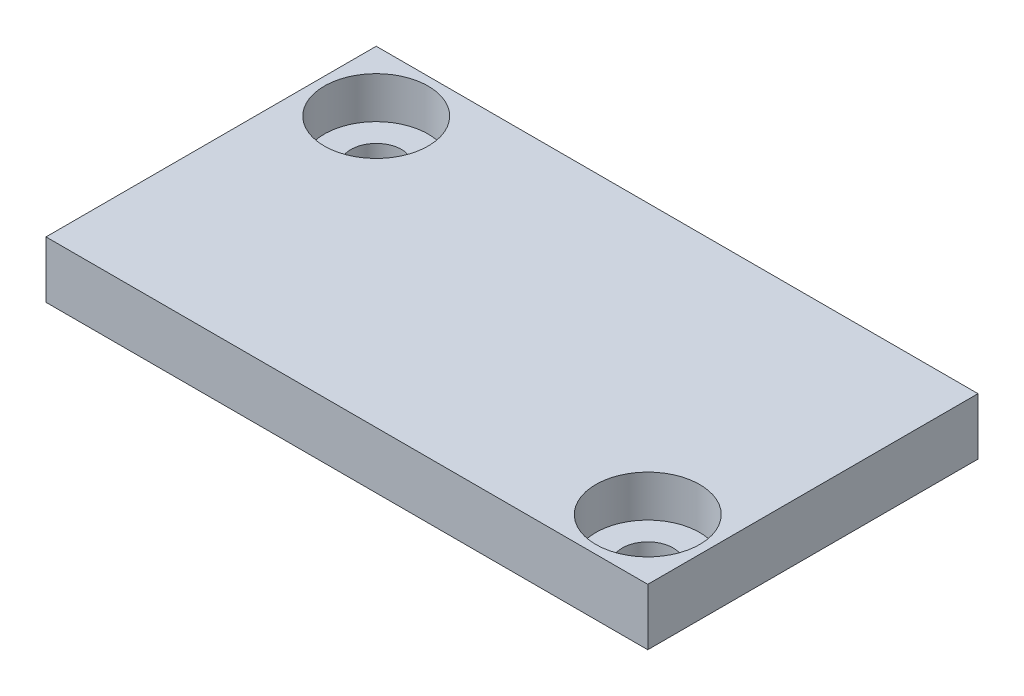
ISO-10303-21;
HEADER;
FILE_DESCRIPTION(('STEP AP214'),'2;1');
FILE_NAME('part.step','',(''),(''),'','','');
FILE_SCHEMA(('AUTOMOTIVE_DESIGN { 1 0 10303 214 1 1 1 1 }'));
ENDSEC;
DATA;
#1=APPLICATION_CONTEXT('core data for automotive mechanical design processes');
#2=APPLICATION_PROTOCOL_DEFINITION('international standard','automotive_design',2000,#1);
#3=PRODUCT_CONTEXT('',#1,'mechanical');
#4=PRODUCT('Part','Part','',(#3));
#5=PRODUCT_RELATED_PRODUCT_CATEGORY('part','',(#4));
#6=PRODUCT_DEFINITION_FORMATION('','',#4);
#7=PRODUCT_DEFINITION_CONTEXT('part definition',#1,'design');
#8=PRODUCT_DEFINITION('design','',#6,#7);
#9=PRODUCT_DEFINITION_SHAPE('','',#8);
#10=(LENGTH_UNIT() NAMED_UNIT(*) SI_UNIT(.MILLI.,.METRE.));
#11=(NAMED_UNIT(*) PLANE_ANGLE_UNIT() SI_UNIT($,.RADIAN.));
#12=(NAMED_UNIT(*) SI_UNIT($,.STERADIAN.) SOLID_ANGLE_UNIT());
#13=UNCERTAINTY_MEASURE_WITH_UNIT(LENGTH_MEASURE(1.E-05),#10,'distance_accuracy_value','');
#14=(GEOMETRIC_REPRESENTATION_CONTEXT(3) GLOBAL_UNCERTAINTY_ASSIGNED_CONTEXT((#13)) GLOBAL_UNIT_ASSIGNED_CONTEXT((#10,
#11,#12)) REPRESENTATION_CONTEXT('',''));
#15=CARTESIAN_POINT('',(0.,0.,0.));
#16=DIRECTION('',(0.,0.,1.));
#17=DIRECTION('',(1.,0.,0.));
#18=AXIS2_PLACEMENT_3D('',#15,#16,#17);
#19=CARTESIAN_POINT('',(20.2204689047881,3.81,-11.096598789213));
#20=DIRECTION('',(-1.,0.,0.));
#21=DIRECTION('',(0.,0.,1.));
#22=AXIS2_PLACEMENT_3D('',#19,#20,#21);
#23=PLANE('',#22);
#24=DIRECTION('',(0.,0.,-1.));
#25=VECTOR('',#24,1.);
#26=CARTESIAN_POINT('',(20.2204689047881,0.,-11.096598789213));
#27=LINE('',#26,#25);
#28=CARTESIAN_POINT('',(20.2204689047881,0.,11.096598789213));
#29=VERTEX_POINT('',#28);
#30=CARTESIAN_POINT('',(20.2204689047881,0.,-11.096598789213));
#31=VERTEX_POINT('',#30);
#32=EDGE_CURVE('E103',#29,#31,#27,.T.);
#33=ORIENTED_EDGE('',*,*,#32,.T.);
#34=DIRECTION('',(0.,-1.,0.));
#35=VECTOR('',#34,1.);
#36=CARTESIAN_POINT('',(20.2204689047881,3.81,-11.096598789213));
#37=LINE('',#36,#35);
#38=CARTESIAN_POINT('',(20.2204689047881,3.81,-11.096598789213));
#39=VERTEX_POINT('',#38);
#40=EDGE_CURVE('E11',#39,#31,#37,.T.);
#41=ORIENTED_EDGE('',*,*,#40,.F.);
#42=DIRECTION('',(0.,0.,-1.));
#43=VECTOR('',#42,1.);
#44=CARTESIAN_POINT('',(20.2204689047881,3.81,-11.096598789213));
#45=LINE('',#44,#43);
#46=CARTESIAN_POINT('',(20.2204689047881,3.81,11.096598789213));
#47=VERTEX_POINT('',#46);
#48=EDGE_CURVE('E90',#47,#39,#45,.T.);
#49=ORIENTED_EDGE('',*,*,#48,.F.);
#50=DIRECTION('',(0.,-1.,0.));
#51=VECTOR('',#50,1.);
#52=CARTESIAN_POINT('',(20.2204689047881,3.81,11.096598789213));
#53=LINE('',#52,#51);
#54=EDGE_CURVE('E99',#47,#29,#53,.T.);
#55=ORIENTED_EDGE('',*,*,#54,.T.);
#56=EDGE_LOOP('',(#33,#41,#49,#55));
#57=FACE_BOUND('',#56,.T.);
#58=ADVANCED_FACE('F37',(#57),#23,.F.);
#59=CARTESIAN_POINT('',(-20.2204689047881,3.81,-11.096598789213));
#60=DIRECTION('',(0.,0.,1.));
#61=DIRECTION('',(1.,0.,0.));
#62=AXIS2_PLACEMENT_3D('',#59,#60,#61);
#63=PLANE('',#62);
#64=DIRECTION('',(-1.,0.,0.));
#65=VECTOR('',#64,1.);
#66=CARTESIAN_POINT('',(-20.2204689047881,0.,-11.096598789213));
#67=LINE('',#66,#65);
#68=CARTESIAN_POINT('',(-20.2204689047881,0.,-11.096598789213));
#69=VERTEX_POINT('',#68);
#70=EDGE_CURVE('E94',#31,#69,#67,.T.);
#71=ORIENTED_EDGE('',*,*,#70,.T.);
#72=DIRECTION('',(0.,-1.,0.));
#73=VECTOR('',#72,1.);
#74=CARTESIAN_POINT('',(-20.2204689047881,3.81,-11.096598789213));
#75=LINE('',#74,#73);
#76=CARTESIAN_POINT('',(-20.2204689047881,3.81,-11.096598789213));
#77=VERTEX_POINT('',#76);
#78=EDGE_CURVE('E46',#77,#69,#75,.T.);
#79=ORIENTED_EDGE('',*,*,#78,.F.);
#80=DIRECTION('',(-1.,0.,0.));
#81=VECTOR('',#80,1.);
#82=CARTESIAN_POINT('',(-20.2204689047881,3.81,-11.096598789213));
#83=LINE('',#82,#81);
#84=EDGE_CURVE('E85',#39,#77,#83,.T.);
#85=ORIENTED_EDGE('',*,*,#84,.F.);
#86=ORIENTED_EDGE('',*,*,#40,.T.);
#87=EDGE_LOOP('',(#71,#79,#85,#86));
#88=FACE_BOUND('',#87,.T.);
#89=ADVANCED_FACE('F93',(#88),#63,.F.);
#90=CARTESIAN_POINT('',(-20.2204689047881,3.81,-11.096598789213));
#91=DIRECTION('',(1.,0.,0.));
#92=DIRECTION('',(0.,0.,-1.));
#93=AXIS2_PLACEMENT_3D('',#90,#91,#92);
#94=PLANE('',#93);
#95=DIRECTION('',(0.,0.,1.));
#96=VECTOR('',#95,1.);
#97=CARTESIAN_POINT('',(-20.2204689047881,0.,-11.096598789213));
#98=LINE('',#97,#96);
#99=CARTESIAN_POINT('',(-20.2204689047881,0.,11.096598789213));
#100=VERTEX_POINT('',#99);
#101=EDGE_CURVE('E72',#69,#100,#98,.T.);
#102=ORIENTED_EDGE('',*,*,#101,.T.);
#103=DIRECTION('',(0.,-1.,0.));
#104=VECTOR('',#103,1.);
#105=CARTESIAN_POINT('',(-20.2204689047881,3.81,11.096598789213));
#106=LINE('',#105,#104);
#107=CARTESIAN_POINT('',(-20.2204689047881,3.81,11.096598789213));
#108=VERTEX_POINT('',#107);
#109=EDGE_CURVE('E95',#108,#100,#106,.T.);
#110=ORIENTED_EDGE('',*,*,#109,.F.);
#111=DIRECTION('',(0.,0.,1.));
#112=VECTOR('',#111,1.);
#113=CARTESIAN_POINT('',(-20.2204689047881,3.81,-11.096598789213));
#114=LINE('',#113,#112);
#115=EDGE_CURVE('E88',#77,#108,#114,.T.);
#116=ORIENTED_EDGE('',*,*,#115,.F.);
#117=ORIENTED_EDGE('',*,*,#78,.T.);
#118=EDGE_LOOP('',(#102,#110,#116,#117));
#119=FACE_BOUND('',#118,.T.);
#120=ADVANCED_FACE('F97',(#119),#94,.F.);
#121=CARTESIAN_POINT('',(-20.2204689047881,3.81,11.096598789213));
#122=DIRECTION('',(0.,0.,-1.));
#123=DIRECTION('',(-1.,0.,0.));
#124=AXIS2_PLACEMENT_3D('',#121,#122,#123);
#125=PLANE('',#124);
#126=DIRECTION('',(1.,0.,0.));
#127=VECTOR('',#126,1.);
#128=CARTESIAN_POINT('',(-20.2204689047881,0.,11.096598789213));
#129=LINE('',#128,#127);
#130=EDGE_CURVE('E78',#100,#29,#129,.T.);
#131=ORIENTED_EDGE('',*,*,#130,.T.);
#132=ORIENTED_EDGE('',*,*,#54,.F.);
#133=DIRECTION('',(1.,0.,0.));
#134=VECTOR('',#133,1.);
#135=CARTESIAN_POINT('',(-20.2204689047881,3.81,11.096598789213));
#136=LINE('',#135,#134);
#137=EDGE_CURVE('E55',#108,#47,#136,.T.);
#138=ORIENTED_EDGE('',*,*,#137,.F.);
#139=ORIENTED_EDGE('',*,*,#109,.T.);
#140=EDGE_LOOP('',(#131,#132,#138,#139));
#141=FACE_BOUND('',#140,.T.);
#142=ADVANCED_FACE('F147',(#141),#125,.F.);
#143=CARTESIAN_POINT('',(0.,3.81,0.));
#144=DIRECTION('',(0.,1.,0.));
#145=DIRECTION('',(0.,0.,1.));
#146=AXIS2_PLACEMENT_3D('',#143,#144,#145);
#147=PLANE('',#146);
#148=CARTESIAN_POINT('',(-16.1564689047881,3.81,-7.03259878921299));
#149=DIRECTION('',(0.,1.,0.));
#150=DIRECTION('',(0.,0.,1.));
#151=AXIS2_PLACEMENT_3D('',#148,#149,#150);
#152=CIRCLE('',#151,3.4925);
#153=CARTESIAN_POINT('',(-16.1564689047881,3.81,-3.54009878921299));
#154=VERTEX_POINT('',#153);
#155=EDGE_CURVE('E128',#154,#154,#152,.T.);
#156=ORIENTED_EDGE('',*,*,#155,.F.);
#157=EDGE_LOOP('',(#156));
#158=FACE_BOUND('',#157,.T.);
#159=CARTESIAN_POINT('',(16.1564689047881,3.81,7.03259878921299));
#160=DIRECTION('',(0.,1.,0.));
#161=DIRECTION('',(0.,0.,1.));
#162=AXIS2_PLACEMENT_3D('',#159,#160,#161);
#163=CIRCLE('',#162,3.4925);
#164=CARTESIAN_POINT('',(16.1564689047881,3.81,10.525098789213));
#165=VERTEX_POINT('',#164);
#166=EDGE_CURVE('E131',#165,#165,#163,.T.);
#167=ORIENTED_EDGE('',*,*,#166,.F.);
#168=EDGE_LOOP('',(#167));
#169=FACE_BOUND('',#168,.T.);
#170=ORIENTED_EDGE('',*,*,#48,.T.);
#171=ORIENTED_EDGE('',*,*,#84,.T.);
#172=ORIENTED_EDGE('',*,*,#115,.T.);
#173=ORIENTED_EDGE('',*,*,#137,.T.);
#174=EDGE_LOOP('',(#170,#171,#172,#173));
#175=FACE_BOUND('',#174,.T.);
#176=ADVANCED_FACE('F86',(#158,#169,#175),#147,.T.);
#177=CARTESIAN_POINT('',(0.,0.,0.));
#178=DIRECTION('',(0.,1.,0.));
#179=DIRECTION('',(0.,0.,1.));
#180=AXIS2_PLACEMENT_3D('',#177,#178,#179);
#181=PLANE('',#180);
#182=CARTESIAN_POINT('',(-16.1564689047881,0.,-7.03259878921299));
#183=DIRECTION('',(0.,1.,0.));
#184=DIRECTION('',(0.,0.,1.));
#185=AXIS2_PLACEMENT_3D('',#182,#183,#184);
#186=CIRCLE('',#185,1.7018);
#187=CARTESIAN_POINT('',(-16.1564689047881,0.,-5.33079878921299));
#188=VERTEX_POINT('',#187);
#189=EDGE_CURVE('E113',#188,#188,#186,.T.);
#190=ORIENTED_EDGE('',*,*,#189,.T.);
#191=EDGE_LOOP('',(#190));
#192=FACE_BOUND('',#191,.T.);
#193=CARTESIAN_POINT('',(16.1564689047881,0.,7.03259878921299));
#194=DIRECTION('',(0.,1.,0.));
#195=DIRECTION('',(0.,0.,1.));
#196=AXIS2_PLACEMENT_3D('',#193,#194,#195);
#197=CIRCLE('',#196,1.7018);
#198=CARTESIAN_POINT('',(16.1564689047881,0.,8.734398789213));
#199=VERTEX_POINT('',#198);
#200=EDGE_CURVE('E119',#199,#199,#197,.T.);
#201=ORIENTED_EDGE('',*,*,#200,.T.);
#202=EDGE_LOOP('',(#201));
#203=FACE_BOUND('',#202,.T.);
#204=ORIENTED_EDGE('',*,*,#32,.F.);
#205=ORIENTED_EDGE('',*,*,#130,.F.);
#206=ORIENTED_EDGE('',*,*,#101,.F.);
#207=ORIENTED_EDGE('',*,*,#70,.F.);
#208=EDGE_LOOP('',(#204,#205,#206,#207));
#209=FACE_BOUND('',#208,.T.);
#210=ADVANCED_FACE('F142',(#192,#203,#209),#181,.F.);
#211=CARTESIAN_POINT('',(16.1564689047881,1.016,7.03259878921299));
#212=DIRECTION('',(0.,1.,0.));
#213=DIRECTION('',(0.,0.,1.));
#214=AXIS2_PLACEMENT_3D('',#211,#212,#213);
#215=CYLINDRICAL_SURFACE('',#214,3.4925);
#216=CARTESIAN_POINT('',(16.1564689047881,1.016,7.03259878921299));
#217=DIRECTION('',(0.,1.,0.));
#218=DIRECTION('',(0.,0.,1.));
#219=AXIS2_PLACEMENT_3D('',#216,#217,#218);
#220=CIRCLE('',#219,3.4925);
#221=CARTESIAN_POINT('',(16.1564689047881,1.016,10.525098789213));
#222=VERTEX_POINT('',#221);
#223=EDGE_CURVE('E117',#222,#222,#220,.T.);
#224=ORIENTED_EDGE('',*,*,#223,.F.);
#225=EDGE_LOOP('',(#224));
#226=FACE_BOUND('',#225,.T.);
#227=ORIENTED_EDGE('',*,*,#166,.T.);
#228=EDGE_LOOP('',(#227));
#229=FACE_BOUND('',#228,.T.);
#230=ADVANCED_FACE('F139',(#226,#229),#215,.F.);
#231=CARTESIAN_POINT('',(16.1564689047881,1.016,7.03259878921299));
#232=DIRECTION('',(0.,1.,0.));
#233=DIRECTION('',(0.,0.,1.));
#234=AXIS2_PLACEMENT_3D('',#231,#232,#233);
#235=PLANE('',#234);
#236=CARTESIAN_POINT('',(16.1564689047881,1.016,7.03259878921299));
#237=DIRECTION('',(0.,1.,0.));
#238=DIRECTION('',(0.,0.,1.));
#239=AXIS2_PLACEMENT_3D('',#236,#237,#238);
#240=CIRCLE('',#239,1.7018);
#241=CARTESIAN_POINT('',(16.1564689047881,1.016,8.734398789213));
#242=VERTEX_POINT('',#241);
#243=EDGE_CURVE('E40',#242,#242,#240,.T.);
#244=ORIENTED_EDGE('',*,*,#243,.F.);
#245=EDGE_LOOP('',(#244));
#246=FACE_BOUND('',#245,.T.);
#247=ORIENTED_EDGE('',*,*,#223,.T.);
#248=EDGE_LOOP('',(#247));
#249=FACE_BOUND('',#248,.T.);
#250=ADVANCED_FACE('F137',(#246,#249),#235,.T.);
#251=CARTESIAN_POINT('',(-16.1564689047881,1.016,-7.03259878921299));
#252=DIRECTION('',(0.,1.,0.));
#253=DIRECTION('',(0.,0.,1.));
#254=AXIS2_PLACEMENT_3D('',#251,#252,#253);
#255=CYLINDRICAL_SURFACE('',#254,3.4925);
#256=CARTESIAN_POINT('',(-16.1564689047881,1.016,-7.03259878921299));
#257=DIRECTION('',(0.,1.,0.));
#258=DIRECTION('',(0.,0.,1.));
#259=AXIS2_PLACEMENT_3D('',#256,#257,#258);
#260=CIRCLE('',#259,3.4925);
#261=CARTESIAN_POINT('',(-16.1564689047881,1.016,-3.54009878921299));
#262=VERTEX_POINT('',#261);
#263=EDGE_CURVE('E106',#262,#262,#260,.T.);
#264=ORIENTED_EDGE('',*,*,#263,.F.);
#265=EDGE_LOOP('',(#264));
#266=FACE_BOUND('',#265,.T.);
#267=ORIENTED_EDGE('',*,*,#155,.T.);
#268=EDGE_LOOP('',(#267));
#269=FACE_BOUND('',#268,.T.);
#270=ADVANCED_FACE('F193',(#266,#269),#255,.F.);
#271=CARTESIAN_POINT('',(-16.1564689047881,1.016,-7.03259878921299));
#272=DIRECTION('',(0.,1.,0.));
#273=DIRECTION('',(0.,0.,1.));
#274=AXIS2_PLACEMENT_3D('',#271,#272,#273);
#275=PLANE('',#274);
#276=CARTESIAN_POINT('',(-16.1564689047881,1.016,-7.03259878921299));
#277=DIRECTION('',(0.,1.,0.));
#278=DIRECTION('',(0.,0.,1.));
#279=AXIS2_PLACEMENT_3D('',#276,#277,#278);
#280=CIRCLE('',#279,1.7018);
#281=CARTESIAN_POINT('',(-16.1564689047881,1.016,-5.33079878921299));
#282=VERTEX_POINT('',#281);
#283=EDGE_CURVE('E111',#282,#282,#280,.T.);
#284=ORIENTED_EDGE('',*,*,#283,.F.);
#285=EDGE_LOOP('',(#284));
#286=FACE_BOUND('',#285,.T.);
#287=ORIENTED_EDGE('',*,*,#263,.T.);
#288=EDGE_LOOP('',(#287));
#289=FACE_BOUND('',#288,.T.);
#290=ADVANCED_FACE('F198',(#286,#289),#275,.T.);
#291=CARTESIAN_POINT('',(-16.1564689047881,0.,-7.03259878921299));
#292=DIRECTION('',(0.,1.,0.));
#293=DIRECTION('',(0.,0.,1.));
#294=AXIS2_PLACEMENT_3D('',#291,#292,#293);
#295=CYLINDRICAL_SURFACE('',#294,1.7018);
#296=CARTESIAN_POINT('',(-16.1564689047881,1.016,-5.33079878921299));
#297=CARTESIAN_POINT('',(-16.1564689047881,1.00541666666667,-5.33079878921299));
#298=CARTESIAN_POINT('',(-16.1564689047881,0.994833333333333,-5.33079878921299));
#299=CARTESIAN_POINT('',(-16.1564689047881,0.973666666666666,-5.33079878921299));
#300=CARTESIAN_POINT('',(-16.1564689047881,0.963083333333333,-5.33079878921299));
#301=CARTESIAN_POINT('',(-16.1564689047881,0.941916666666666,-5.33079878921299));
#302=CARTESIAN_POINT('',(-16.1564689047881,0.931333333333333,-5.33079878921299));
#303=CARTESIAN_POINT('',(-16.1564689047881,0.910166666666666,-5.33079878921299));
#304=CARTESIAN_POINT('',(-16.1564689047881,0.899583333333333,-5.33079878921299));
#305=CARTESIAN_POINT('',(-16.1564689047881,0.878416666666666,-5.33079878921299));
#306=CARTESIAN_POINT('',(-16.1564689047881,0.867833333333333,-5.33079878921299));
#307=CARTESIAN_POINT('',(-16.1564689047881,0.846666666666666,-5.33079878921299));
#308=CARTESIAN_POINT('',(-16.1564689047881,0.836083333333333,-5.33079878921299));
#309=CARTESIAN_POINT('',(-16.1564689047881,0.814916666666666,-5.33079878921299));
#310=CARTESIAN_POINT('',(-16.1564689047881,0.804333333333333,-5.33079878921299));
#311=CARTESIAN_POINT('',(-16.1564689047881,0.783166666666666,-5.33079878921299));
#312=CARTESIAN_POINT('',(-16.1564689047881,0.772583333333333,-5.33079878921299));
#313=CARTESIAN_POINT('',(-16.1564689047881,0.751416666666666,-5.33079878921299));
#314=CARTESIAN_POINT('',(-16.1564689047881,0.740833333333333,-5.33079878921299));
#315=CARTESIAN_POINT('',(-16.1564689047881,0.719666666666666,-5.33079878921299));
#316=CARTESIAN_POINT('',(-16.1564689047881,0.709083333333333,-5.33079878921299));
#317=CARTESIAN_POINT('',(-16.1564689047881,0.687916666666666,-5.33079878921299));
#318=CARTESIAN_POINT('',(-16.1564689047881,0.677333333333333,-5.33079878921299));
#319=CARTESIAN_POINT('',(-16.1564689047881,0.656166666666666,-5.33079878921299));
#320=CARTESIAN_POINT('',(-16.1564689047881,0.645583333333333,-5.33079878921299));
#321=CARTESIAN_POINT('',(-16.1564689047881,0.624416666666666,-5.33079878921299));
#322=CARTESIAN_POINT('',(-16.1564689047881,0.613833333333333,-5.33079878921299));
#323=CARTESIAN_POINT('',(-16.1564689047881,0.592666666666666,-5.33079878921299));
#324=CARTESIAN_POINT('',(-16.1564689047881,0.582083333333333,-5.33079878921299));
#325=CARTESIAN_POINT('',(-16.1564689047881,0.560916666666666,-5.33079878921299));
#326=CARTESIAN_POINT('',(-16.1564689047881,0.550333333333333,-5.33079878921299));
#327=CARTESIAN_POINT('',(-16.1564689047881,0.529166666666666,-5.33079878921299));
#328=CARTESIAN_POINT('',(-16.1564689047881,0.518583333333333,-5.33079878921299));
#329=CARTESIAN_POINT('',(-16.1564689047881,0.497416666666666,-5.33079878921299));
#330=CARTESIAN_POINT('',(-16.1564689047881,0.486833333333333,-5.33079878921299));
#331=CARTESIAN_POINT('',(-16.1564689047881,0.465666666666666,-5.33079878921299));
#332=CARTESIAN_POINT('',(-16.1564689047881,0.455083333333333,-5.33079878921299));
#333=CARTESIAN_POINT('',(-16.1564689047881,0.433916666666666,-5.33079878921299));
#334=CARTESIAN_POINT('',(-16.1564689047881,0.423333333333333,-5.33079878921299));
#335=CARTESIAN_POINT('',(-16.1564689047881,0.402166666666666,-5.33079878921299));
#336=CARTESIAN_POINT('',(-16.1564689047881,0.391583333333333,-5.33079878921299));
#337=CARTESIAN_POINT('',(-16.1564689047881,0.370416666666666,-5.33079878921299));
#338=CARTESIAN_POINT('',(-16.1564689047881,0.359833333333333,-5.33079878921299));
#339=CARTESIAN_POINT('',(-16.1564689047881,0.338666666666667,-5.33079878921299));
#340=CARTESIAN_POINT('',(-16.1564689047881,0.328083333333333,-5.33079878921299));
#341=CARTESIAN_POINT('',(-16.1564689047881,0.306916666666667,-5.33079878921299));
#342=CARTESIAN_POINT('',(-16.1564689047881,0.296333333333333,-5.33079878921299));
#343=CARTESIAN_POINT('',(-16.1564689047881,0.275166666666667,-5.33079878921299));
#344=CARTESIAN_POINT('',(-16.1564689047881,0.264583333333333,-5.33079878921299));
#345=CARTESIAN_POINT('',(-16.1564689047881,0.243416666666667,-5.33079878921299));
#346=CARTESIAN_POINT('',(-16.1564689047881,0.232833333333333,-5.33079878921299));
#347=CARTESIAN_POINT('',(-16.1564689047881,0.211666666666667,-5.33079878921299));
#348=CARTESIAN_POINT('',(-16.1564689047881,0.201083333333333,-5.33079878921299));
#349=CARTESIAN_POINT('',(-16.1564689047881,0.179916666666667,-5.33079878921299));
#350=CARTESIAN_POINT('',(-16.1564689047881,0.169333333333333,-5.33079878921299));
#351=CARTESIAN_POINT('',(-16.1564689047881,0.148166666666667,-5.33079878921299));
#352=CARTESIAN_POINT('',(-16.1564689047881,0.137583333333333,-5.33079878921299));
#353=CARTESIAN_POINT('',(-16.1564689047881,0.116416666666667,-5.33079878921299));
#354=CARTESIAN_POINT('',(-16.1564689047881,0.105833333333333,-5.33079878921299));
#355=CARTESIAN_POINT('',(-16.1564689047881,0.0846666666666666,-5.33079878921299));
#356=CARTESIAN_POINT('',(-16.1564689047881,0.0740833333333333,-5.33079878921299));
#357=CARTESIAN_POINT('',(-16.1564689047881,0.0529166666666667,-5.33079878921299));
#358=CARTESIAN_POINT('',(-16.1564689047881,0.0423333333333334,-5.33079878921299));
#359=CARTESIAN_POINT('',(-16.1564689047881,0.0211666666666667,-5.33079878921299));
#360=CARTESIAN_POINT('',(-16.1564689047881,0.0105833333333334,-5.33079878921299));
#361=CARTESIAN_POINT('',(-16.1564689047881,0.,-5.33079878921299));
#362=B_SPLINE_CURVE_WITH_KNOTS('',3,(#296,#297,#298,#299,#300,#301,#302,#303,#304,#305,#306,
#307,#308,#309,#310,#311,#312,#313,#314,#315,#316,#317,#318,#319,#320,#321,#322,#323,#324,#325,
#326,#327,#328,#329,#330,#331,#332,#333,#334,#335,#336,#337,#338,#339,#340,#341,#342,#343,#344,
#345,#346,#347,#348,#349,#350,#351,#352,#353,#354,#355,#356,#357,#358,#359,#360,#361),
.UNSPECIFIED.,.F.,.F.,(4,2,2,2,2,2,2,2,2,2,2,2,2,2,2,2,2,2,2,2,2,2,2,2,2,2,2,2,2,2,2,2,4),(0.,
0.0317500000000001,0.0634999999999999,0.0952499999999998,0.127,0.15875,0.1905,0.22225,0.254,
0.28575,0.3175,0.34925,0.381,0.41275,0.4445,0.47625,0.508,0.53975,0.5715,0.60325,0.635,0.66675,
0.6985,0.73025,0.762,0.79375,0.8255,0.85725,0.888999999999999,0.92075,0.952499999999999,
0.984249999999999,1.016),.UNSPECIFIED.);
#363=EDGE_CURVE('BSEAM219',#282,#188,#362,.T.);
#364=ORIENTED_EDGE('',*,*,#283,.T.);
#365=ORIENTED_EDGE('',*,*,#189,.F.);
#366=ORIENTED_EDGE('',*,*,#363,.T.);
#367=ORIENTED_EDGE('',*,*,#363,.F.);
#368=EDGE_LOOP('',(#364,#366,#365,#367));
#369=FACE_BOUND('',#368,.T.);
#370=ADVANCED_FACE('F219',(#369),#295,.F.);
#371=CARTESIAN_POINT('',(16.1564689047881,0.,7.03259878921299));
#372=DIRECTION('',(0.,1.,0.));
#373=DIRECTION('',(0.,0.,1.));
#374=AXIS2_PLACEMENT_3D('',#371,#372,#373);
#375=CYLINDRICAL_SURFACE('',#374,1.7018);
#376=CARTESIAN_POINT('',(16.1564689047881,1.016,8.734398789213));
#377=CARTESIAN_POINT('',(16.1564689047881,1.00541666666667,8.734398789213));
#378=CARTESIAN_POINT('',(16.1564689047881,0.994833333333333,8.734398789213));
#379=CARTESIAN_POINT('',(16.1564689047881,0.973666666666666,8.734398789213));
#380=CARTESIAN_POINT('',(16.1564689047881,0.963083333333333,8.734398789213));
#381=CARTESIAN_POINT('',(16.1564689047881,0.941916666666666,8.734398789213));
#382=CARTESIAN_POINT('',(16.1564689047881,0.931333333333333,8.734398789213));
#383=CARTESIAN_POINT('',(16.1564689047881,0.910166666666666,8.734398789213));
#384=CARTESIAN_POINT('',(16.1564689047881,0.899583333333333,8.734398789213));
#385=CARTESIAN_POINT('',(16.1564689047881,0.878416666666666,8.734398789213));
#386=CARTESIAN_POINT('',(16.1564689047881,0.867833333333333,8.734398789213));
#387=CARTESIAN_POINT('',(16.1564689047881,0.846666666666666,8.734398789213));
#388=CARTESIAN_POINT('',(16.1564689047881,0.836083333333333,8.734398789213));
#389=CARTESIAN_POINT('',(16.1564689047881,0.814916666666666,8.734398789213));
#390=CARTESIAN_POINT('',(16.1564689047881,0.804333333333333,8.734398789213));
#391=CARTESIAN_POINT('',(16.1564689047881,0.783166666666666,8.734398789213));
#392=CARTESIAN_POINT('',(16.1564689047881,0.772583333333333,8.734398789213));
#393=CARTESIAN_POINT('',(16.1564689047881,0.751416666666666,8.734398789213));
#394=CARTESIAN_POINT('',(16.1564689047881,0.740833333333333,8.734398789213));
#395=CARTESIAN_POINT('',(16.1564689047881,0.719666666666666,8.734398789213));
#396=CARTESIAN_POINT('',(16.1564689047881,0.709083333333333,8.734398789213));
#397=CARTESIAN_POINT('',(16.1564689047881,0.687916666666666,8.734398789213));
#398=CARTESIAN_POINT('',(16.1564689047881,0.677333333333333,8.734398789213));
#399=CARTESIAN_POINT('',(16.1564689047881,0.656166666666666,8.734398789213));
#400=CARTESIAN_POINT('',(16.1564689047881,0.645583333333333,8.734398789213));
#401=CARTESIAN_POINT('',(16.1564689047881,0.624416666666666,8.734398789213));
#402=CARTESIAN_POINT('',(16.1564689047881,0.613833333333333,8.734398789213));
#403=CARTESIAN_POINT('',(16.1564689047881,0.592666666666666,8.734398789213));
#404=CARTESIAN_POINT('',(16.1564689047881,0.582083333333333,8.734398789213));
#405=CARTESIAN_POINT('',(16.1564689047881,0.560916666666666,8.734398789213));
#406=CARTESIAN_POINT('',(16.1564689047881,0.550333333333333,8.734398789213));
#407=CARTESIAN_POINT('',(16.1564689047881,0.529166666666666,8.734398789213));
#408=CARTESIAN_POINT('',(16.1564689047881,0.518583333333333,8.734398789213));
#409=CARTESIAN_POINT('',(16.1564689047881,0.497416666666666,8.734398789213));
#410=CARTESIAN_POINT('',(16.1564689047881,0.486833333333333,8.734398789213));
#411=CARTESIAN_POINT('',(16.1564689047881,0.465666666666666,8.734398789213));
#412=CARTESIAN_POINT('',(16.1564689047881,0.455083333333333,8.734398789213));
#413=CARTESIAN_POINT('',(16.1564689047881,0.433916666666666,8.734398789213));
#414=CARTESIAN_POINT('',(16.1564689047881,0.423333333333333,8.734398789213));
#415=CARTESIAN_POINT('',(16.1564689047881,0.402166666666666,8.734398789213));
#416=CARTESIAN_POINT('',(16.1564689047881,0.391583333333333,8.734398789213));
#417=CARTESIAN_POINT('',(16.1564689047881,0.370416666666666,8.734398789213));
#418=CARTESIAN_POINT('',(16.1564689047881,0.359833333333333,8.734398789213));
#419=CARTESIAN_POINT('',(16.1564689047881,0.338666666666667,8.734398789213));
#420=CARTESIAN_POINT('',(16.1564689047881,0.328083333333333,8.734398789213));
#421=CARTESIAN_POINT('',(16.1564689047881,0.306916666666667,8.734398789213));
#422=CARTESIAN_POINT('',(16.1564689047881,0.296333333333333,8.734398789213));
#423=CARTESIAN_POINT('',(16.1564689047881,0.275166666666667,8.734398789213));
#424=CARTESIAN_POINT('',(16.1564689047881,0.264583333333333,8.734398789213));
#425=CARTESIAN_POINT('',(16.1564689047881,0.243416666666667,8.734398789213));
#426=CARTESIAN_POINT('',(16.1564689047881,0.232833333333333,8.734398789213));
#427=CARTESIAN_POINT('',(16.1564689047881,0.211666666666667,8.734398789213));
#428=CARTESIAN_POINT('',(16.1564689047881,0.201083333333333,8.734398789213));
#429=CARTESIAN_POINT('',(16.1564689047881,0.179916666666667,8.734398789213));
#430=CARTESIAN_POINT('',(16.1564689047881,0.169333333333333,8.734398789213));
#431=CARTESIAN_POINT('',(16.1564689047881,0.148166666666667,8.734398789213));
#432=CARTESIAN_POINT('',(16.1564689047881,0.137583333333333,8.734398789213));
#433=CARTESIAN_POINT('',(16.1564689047881,0.116416666666667,8.734398789213));
#434=CARTESIAN_POINT('',(16.1564689047881,0.105833333333333,8.734398789213));
#435=CARTESIAN_POINT('',(16.1564689047881,0.0846666666666666,8.734398789213));
#436=CARTESIAN_POINT('',(16.1564689047881,0.0740833333333333,8.734398789213));
#437=CARTESIAN_POINT('',(16.1564689047881,0.0529166666666667,8.734398789213));
#438=CARTESIAN_POINT('',(16.1564689047881,0.0423333333333334,8.734398789213));
#439=CARTESIAN_POINT('',(16.1564689047881,0.0211666666666667,8.734398789213));
#440=CARTESIAN_POINT('',(16.1564689047881,0.0105833333333334,8.734398789213));
#441=CARTESIAN_POINT('',(16.1564689047881,0.,8.734398789213));
#442=B_SPLINE_CURVE_WITH_KNOTS('',3,(#376,#377,#378,#379,#380,#381,#382,#383,#384,#385,#386,
#387,#388,#389,#390,#391,#392,#393,#394,#395,#396,#397,#398,#399,#400,#401,#402,#403,#404,#405,
#406,#407,#408,#409,#410,#411,#412,#413,#414,#415,#416,#417,#418,#419,#420,#421,#422,#423,#424,
#425,#426,#427,#428,#429,#430,#431,#432,#433,#434,#435,#436,#437,#438,#439,#440,#441),
.UNSPECIFIED.,.F.,.F.,(4,2,2,2,2,2,2,2,2,2,2,2,2,2,2,2,2,2,2,2,2,2,2,2,2,2,2,2,2,2,2,2,4),(0.,
0.0317500000000001,0.0634999999999999,0.0952499999999998,0.127,0.15875,0.1905,0.22225,0.254,
0.28575,0.3175,0.34925,0.381,0.41275,0.4445,0.47625,0.508,0.53975,0.5715,0.60325,0.635,0.66675,
0.6985,0.73025,0.762,0.79375,0.8255,0.85725,0.888999999999999,0.92075,0.952499999999999,
0.984249999999999,1.016),.UNSPECIFIED.);
#443=EDGE_CURVE('BSEAM229',#242,#199,#442,.T.);
#444=ORIENTED_EDGE('',*,*,#243,.T.);
#445=ORIENTED_EDGE('',*,*,#200,.F.);
#446=ORIENTED_EDGE('',*,*,#443,.T.);
#447=ORIENTED_EDGE('',*,*,#443,.F.);
#448=EDGE_LOOP('',(#444,#446,#445,#447));
#449=FACE_BOUND('',#448,.T.);
#450=ADVANCED_FACE('F229',(#449),#375,.F.);
#451=CLOSED_SHELL('',(#58,#89,#120,#142,#176,#210,#230,#250,#270,#290,#370,#450));
#452=MANIFOLD_SOLID_BREP('B2',#451);
#453=ADVANCED_BREP_SHAPE_REPRESENTATION('',(#18,#452),#14);
#454=SHAPE_DEFINITION_REPRESENTATION(#9,#453);
ENDSEC;
END-ISO-10303-21;
